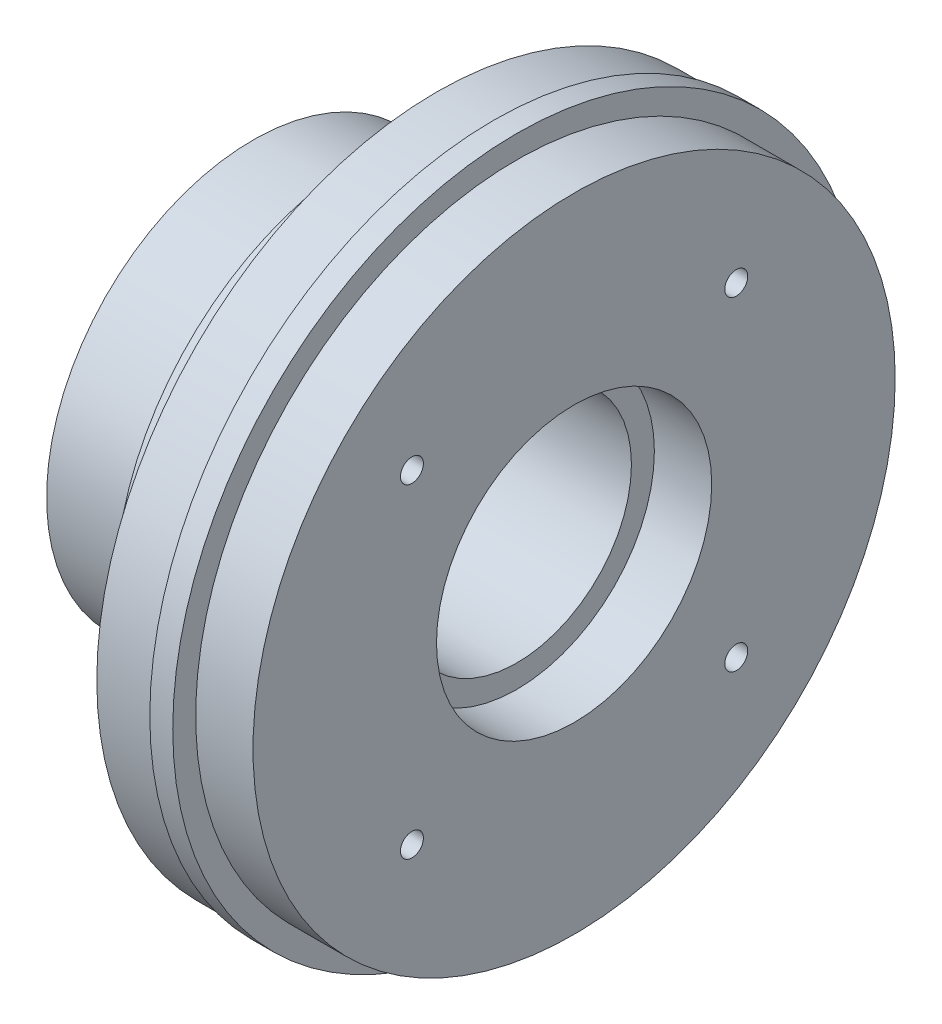
ISO-10303-21;
HEADER;
FILE_DESCRIPTION(('STEP AP214'),'2;1');
FILE_NAME('part.step','',(''),(''),'','','');
FILE_SCHEMA(('AUTOMOTIVE_DESIGN { 1 0 10303 214 1 1 1 1 }'));
ENDSEC;
DATA;
#1=APPLICATION_CONTEXT('core data for automotive mechanical design processes');
#2=APPLICATION_PROTOCOL_DEFINITION('international standard','automotive_design',2000,#1);
#3=PRODUCT_CONTEXT('',#1,'mechanical');
#4=PRODUCT('Part','Part','',(#3));
#5=PRODUCT_RELATED_PRODUCT_CATEGORY('part','',(#4));
#6=PRODUCT_DEFINITION_FORMATION('','',#4);
#7=PRODUCT_DEFINITION_CONTEXT('part definition',#1,'design');
#8=PRODUCT_DEFINITION('design','',#6,#7);
#9=PRODUCT_DEFINITION_SHAPE('','',#8);
#10=(LENGTH_UNIT() NAMED_UNIT(*) SI_UNIT(.MILLI.,.METRE.));
#11=(NAMED_UNIT(*) PLANE_ANGLE_UNIT() SI_UNIT($,.RADIAN.));
#12=(NAMED_UNIT(*) SI_UNIT($,.STERADIAN.) SOLID_ANGLE_UNIT());
#13=UNCERTAINTY_MEASURE_WITH_UNIT(LENGTH_MEASURE(1.E-05),#10,'distance_accuracy_value','');
#14=(GEOMETRIC_REPRESENTATION_CONTEXT(3) GLOBAL_UNCERTAINTY_ASSIGNED_CONTEXT((#13)) GLOBAL_UNIT_ASSIGNED_CONTEXT((#10,
#11,#12)) REPRESENTATION_CONTEXT('',''));
#15=CARTESIAN_POINT('',(0.,0.,0.));
#16=DIRECTION('',(0.,0.,1.));
#17=DIRECTION('',(1.,0.,0.));
#18=AXIS2_PLACEMENT_3D('',#15,#16,#17);
#19=CARTESIAN_POINT('',(13.5,0.,0.));
#20=DIRECTION('',(1.,0.,0.));
#21=DIRECTION('',(0.,0.,-1.));
#22=AXIS2_PLACEMENT_3D('',#19,#20,#21);
#23=TOROIDAL_SURFACE('',#22,26.,4.);
#24=CARTESIAN_POINT('',(16.9641016151378,0.,0.));
#25=DIRECTION('',(1.,0.,0.));
#26=DIRECTION('',(0.,0.,-1.));
#27=AXIS2_PLACEMENT_3D('',#24,#25,#26);
#28=CIRCLE('',#27,24.);
#29=CARTESIAN_POINT('',(16.9641016151378,0.,-24.));
#30=VERTEX_POINT('',#29);
#31=EDGE_CURVE('E125',#30,#30,#28,.F.);
#32=ORIENTED_EDGE('',*,*,#31,.F.);
#33=EDGE_LOOP('',(#32));
#34=FACE_BOUND('',#33,.T.);
#35=CARTESIAN_POINT('',(16.,0.,0.));
#36=DIRECTION('',(1.,0.,0.));
#37=DIRECTION('',(0.,0.,-1.));
#38=AXIS2_PLACEMENT_3D('',#35,#36,#37);
#39=CIRCLE('',#38,29.1224989991992);
#40=CARTESIAN_POINT('',(16.,0.,-29.1224989991992));
#41=VERTEX_POINT('',#40);
#42=EDGE_CURVE('E123',#41,#41,#39,.T.);
#43=ORIENTED_EDGE('',*,*,#42,.F.);
#44=EDGE_LOOP('',(#43));
#45=FACE_BOUND('',#44,.T.);
#46=ADVANCED_FACE('F14',(#34,#45),#23,.F.);
#47=CARTESIAN_POINT('',(22.3157894736842,0.,0.));
#48=DIRECTION('',(1.,0.,0.));
#49=DIRECTION('',(0.,0.,-1.));
#50=AXIS2_PLACEMENT_3D('',#47,#48,#49);
#51=CYLINDRICAL_SURFACE('',#50,15.);
#52=CARTESIAN_POINT('',(2.,0.,0.));
#53=DIRECTION('',(1.,0.,0.));
#54=DIRECTION('',(0.,0.,-1.));
#55=AXIS2_PLACEMENT_3D('',#52,#53,#54);
#56=CIRCLE('',#55,15.);
#57=CARTESIAN_POINT('',(2.,0.,-15.));
#58=VERTEX_POINT('',#57);
#59=EDGE_CURVE('E120',#58,#58,#56,.F.);
#60=ORIENTED_EDGE('',*,*,#59,.F.);
#61=EDGE_LOOP('',(#60));
#62=FACE_BOUND('',#61,.T.);
#63=CARTESIAN_POINT('',(0.,0.,0.));
#64=DIRECTION('',(1.,0.,0.));
#65=DIRECTION('',(0.,0.,-1.));
#66=AXIS2_PLACEMENT_3D('',#63,#64,#65);
#67=CIRCLE('',#66,15.);
#68=CARTESIAN_POINT('',(0.,0.,-15.));
#69=VERTEX_POINT('',#68);
#70=EDGE_CURVE('E18',#69,#69,#67,.T.);
#71=ORIENTED_EDGE('',*,*,#70,.F.);
#72=EDGE_LOOP('',(#71));
#73=FACE_BOUND('',#72,.T.);
#74=ADVANCED_FACE('F134',(#62,#73),#51,.F.);
#75=CARTESIAN_POINT('',(0.,18.,0.));
#76=DIRECTION('',(-1.,0.,0.));
#77=DIRECTION('',(0.,0.,1.));
#78=AXIS2_PLACEMENT_3D('',#75,#76,#77);
#79=PLANE('',#78);
#80=CARTESIAN_POINT('',(0.,0.,0.));
#81=DIRECTION('',(1.,0.,0.));
#82=DIRECTION('',(0.,0.,-1.));
#83=AXIS2_PLACEMENT_3D('',#80,#81,#82);
#84=CIRCLE('',#83,18.);
#85=CARTESIAN_POINT('',(0.,0.,-18.));
#86=VERTEX_POINT('',#85);
#87=EDGE_CURVE('E117',#86,#86,#84,.T.);
#88=ORIENTED_EDGE('',*,*,#87,.F.);
#89=EDGE_LOOP('',(#88));
#90=FACE_BOUND('',#89,.T.);
#91=ORIENTED_EDGE('',*,*,#70,.T.);
#92=EDGE_LOOP('',(#91));
#93=FACE_BOUND('',#92,.T.);
#94=ADVANCED_FACE('F132',(#90,#93),#79,.T.);
#95=CARTESIAN_POINT('',(16.9641016151378,24.,0.));
#96=DIRECTION('',(-1.,0.,0.));
#97=DIRECTION('',(0.,0.,1.));
#98=AXIS2_PLACEMENT_3D('',#95,#96,#97);
#99=PLANE('',#98);
#100=ORIENTED_EDGE('',*,*,#31,.T.);
#101=EDGE_LOOP('',(#100));
#102=FACE_BOUND('',#101,.T.);
#103=CARTESIAN_POINT('',(16.9641016151378,0.,0.));
#104=DIRECTION('',(1.,0.,0.));
#105=DIRECTION('',(0.,0.,-1.));
#106=AXIS2_PLACEMENT_3D('',#103,#104,#105);
#107=CIRCLE('',#106,22.);
#108=CARTESIAN_POINT('',(16.9641016151378,0.,-22.));
#109=VERTEX_POINT('',#108);
#110=EDGE_CURVE('E114',#109,#109,#107,.F.);
#111=ORIENTED_EDGE('',*,*,#110,.F.);
#112=EDGE_LOOP('',(#111));
#113=FACE_BOUND('',#112,.T.);
#114=ADVANCED_FACE('F142',(#102,#113),#99,.T.);
#115=CARTESIAN_POINT('',(16.,29.6224989991992,0.));
#116=DIRECTION('',(-1.,0.,0.));
#117=DIRECTION('',(0.,0.,1.));
#118=AXIS2_PLACEMENT_3D('',#115,#116,#117);
#119=PLANE('',#118);
#120=CARTESIAN_POINT('',(16.,0.,0.));
#121=DIRECTION('',(1.,0.,0.));
#122=DIRECTION('',(0.,0.,-1.));
#123=AXIS2_PLACEMENT_3D('',#120,#121,#122);
#124=CIRCLE('',#123,29.6224989991992);
#125=CARTESIAN_POINT('',(16.,0.,-29.6224989991992));
#126=VERTEX_POINT('',#125);
#127=EDGE_CURVE('E111',#126,#126,#124,.T.);
#128=ORIENTED_EDGE('',*,*,#127,.F.);
#129=EDGE_LOOP('',(#128));
#130=FACE_BOUND('',#129,.T.);
#131=ORIENTED_EDGE('',*,*,#42,.T.);
#132=EDGE_LOOP('',(#131));
#133=FACE_BOUND('',#132,.T.);
#134=ADVANCED_FACE('F258',(#130,#133),#119,.T.);
#135=CARTESIAN_POINT('',(2.,15.,0.));
#136=DIRECTION('',(-1.,0.,0.));
#137=DIRECTION('',(0.,0.,1.));
#138=AXIS2_PLACEMENT_3D('',#135,#136,#137);
#139=PLANE('',#138);
#140=ORIENTED_EDGE('',*,*,#59,.T.);
#141=EDGE_LOOP('',(#140));
#142=FACE_BOUND('',#141,.T.);
#143=CARTESIAN_POINT('',(2.,0.,0.));
#144=DIRECTION('',(1.,0.,0.));
#145=DIRECTION('',(0.,0.,-1.));
#146=AXIS2_PLACEMENT_3D('',#143,#144,#145);
#147=CIRCLE('',#146,13.);
#148=CARTESIAN_POINT('',(2.,0.,-13.));
#149=VERTEX_POINT('',#148);
#150=EDGE_CURVE('E108',#149,#149,#147,.F.);
#151=ORIENTED_EDGE('',*,*,#150,.F.);
#152=EDGE_LOOP('',(#151));
#153=FACE_BOUND('',#152,.T.);
#154=ADVANCED_FACE('F254',(#142,#153),#139,.T.);
#155=CARTESIAN_POINT('',(22.3157894736842,0.,0.));
#156=DIRECTION('',(1.,0.,0.));
#157=DIRECTION('',(0.,0.,-1.));
#158=AXIS2_PLACEMENT_3D('',#155,#156,#157);
#159=CYLINDRICAL_SURFACE('',#158,18.);
#160=ORIENTED_EDGE('',*,*,#87,.T.);
#161=EDGE_LOOP('',(#160));
#162=FACE_BOUND('',#161,.T.);
#163=CARTESIAN_POINT('',(10.,0.,0.));
#164=DIRECTION('',(1.,0.,0.));
#165=DIRECTION('',(0.,0.,-1.));
#166=AXIS2_PLACEMENT_3D('',#163,#164,#165);
#167=CIRCLE('',#166,18.);
#168=CARTESIAN_POINT('',(10.,0.,-18.));
#169=VERTEX_POINT('',#168);
#170=EDGE_CURVE('E105',#169,#169,#167,.T.);
#171=ORIENTED_EDGE('',*,*,#170,.F.);
#172=EDGE_LOOP('',(#171));
#173=FACE_BOUND('',#172,.T.);
#174=ADVANCED_FACE('F250',(#162,#173),#159,.T.);
#175=CARTESIAN_POINT('',(22.3157894736842,0.,0.));
#176=DIRECTION('',(1.,0.,0.));
#177=DIRECTION('',(0.,0.,-1.));
#178=AXIS2_PLACEMENT_3D('',#175,#176,#177);
#179=CYLINDRICAL_SURFACE('',#178,22.);
#180=CARTESIAN_POINT('',(10.,0.,0.));
#181=DIRECTION('',(1.,0.,0.));
#182=DIRECTION('',(0.,0.,-1.));
#183=AXIS2_PLACEMENT_3D('',#180,#181,#182);
#184=CIRCLE('',#183,22.);
#185=CARTESIAN_POINT('',(10.,0.,-22.));
#186=VERTEX_POINT('',#185);
#187=EDGE_CURVE('E102',#186,#186,#184,.F.);
#188=ORIENTED_EDGE('',*,*,#187,.F.);
#189=EDGE_LOOP('',(#188));
#190=FACE_BOUND('',#189,.T.);
#191=ORIENTED_EDGE('',*,*,#110,.T.);
#192=EDGE_LOOP('',(#191));
#193=FACE_BOUND('',#192,.T.);
#194=ADVANCED_FACE('F246',(#190,#193),#179,.T.);
#195=CARTESIAN_POINT('',(22.3157894736842,0.,0.));
#196=DIRECTION('',(1.,0.,0.));
#197=DIRECTION('',(0.,0.,-1.));
#198=AXIS2_PLACEMENT_3D('',#195,#196,#197);
#199=CYLINDRICAL_SURFACE('',#198,29.6224989991992);
#200=ORIENTED_EDGE('',*,*,#127,.T.);
#201=EDGE_LOOP('',(#200));
#202=FACE_BOUND('',#201,.T.);
#203=CARTESIAN_POINT('',(21.,0.,0.));
#204=DIRECTION('',(1.,0.,0.));
#205=DIRECTION('',(0.,0.,-1.));
#206=AXIS2_PLACEMENT_3D('',#203,#204,#205);
#207=CIRCLE('',#206,29.6224989991992);
#208=CARTESIAN_POINT('',(21.,0.,-29.6224989991992));
#209=VERTEX_POINT('',#208);
#210=EDGE_CURVE('E99',#209,#209,#207,.T.);
#211=ORIENTED_EDGE('',*,*,#210,.F.);
#212=EDGE_LOOP('',(#211));
#213=FACE_BOUND('',#212,.T.);
#214=ADVANCED_FACE('F242',(#202,#213),#199,.T.);
#215=CARTESIAN_POINT('',(22.3157894736842,0.,0.));
#216=DIRECTION('',(1.,0.,0.));
#217=DIRECTION('',(0.,0.,-1.));
#218=AXIS2_PLACEMENT_3D('',#215,#216,#217);
#219=CYLINDRICAL_SURFACE('',#218,13.);
#220=CARTESIAN_POINT('',(0.,0.,0.));
#221=DIRECTION('',(1.,0.,0.));
#222=DIRECTION('',(0.,0.,-1.));
#223=AXIS2_PLACEMENT_3D('',#220,#221,#222);
#224=CIRCLE('',#223,13.);
#225=CARTESIAN_POINT('',(0.,0.,-13.));
#226=VERTEX_POINT('',#225);
#227=EDGE_CURVE('E96',#226,#226,#224,.F.);
#228=ORIENTED_EDGE('',*,*,#227,.F.);
#229=EDGE_LOOP('',(#228));
#230=FACE_BOUND('',#229,.T.);
#231=ORIENTED_EDGE('',*,*,#150,.T.);
#232=EDGE_LOOP('',(#231));
#233=FACE_BOUND('',#232,.T.);
#234=ADVANCED_FACE('F238',(#230,#233),#219,.T.);
#235=CARTESIAN_POINT('',(10.,22.,0.));
#236=DIRECTION('',(-1.,0.,0.));
#237=DIRECTION('',(0.,0.,1.));
#238=AXIS2_PLACEMENT_3D('',#235,#236,#237);
#239=PLANE('',#238);
#240=ORIENTED_EDGE('',*,*,#187,.T.);
#241=EDGE_LOOP('',(#240));
#242=FACE_BOUND('',#241,.T.);
#243=ORIENTED_EDGE('',*,*,#170,.T.);
#244=EDGE_LOOP('',(#243));
#245=FACE_BOUND('',#244,.T.);
#246=CARTESIAN_POINT('',(10.,14.142135623731,14.1421356237309));
#247=DIRECTION('',(-1.,0.,0.));
#248=DIRECTION('',(0.,0.,1.));
#249=AXIS2_PLACEMENT_3D('',#246,#247,#248);
#250=CIRCLE('',#249,1.9);
#251=CARTESIAN_POINT('',(10.,14.142135623731,16.0421356237309));
#252=VERTEX_POINT('',#251);
#253=EDGE_CURVE('E84',#252,#252,#250,.F.);
#254=ORIENTED_EDGE('',*,*,#253,.T.);
#255=EDGE_LOOP('',(#254));
#256=FACE_BOUND('',#255,.T.);
#257=CARTESIAN_POINT('',(10.,-14.1421356237309,14.142135623731));
#258=DIRECTION('',(-1.,0.,0.));
#259=DIRECTION('',(0.,0.,1.));
#260=AXIS2_PLACEMENT_3D('',#257,#258,#259);
#261=CIRCLE('',#260,1.9);
#262=CARTESIAN_POINT('',(10.,-14.1421356237309,16.042135623731));
#263=VERTEX_POINT('',#262);
#264=EDGE_CURVE('E87',#263,#263,#261,.F.);
#265=ORIENTED_EDGE('',*,*,#264,.T.);
#266=EDGE_LOOP('',(#265));
#267=FACE_BOUND('',#266,.T.);
#268=CARTESIAN_POINT('',(10.,-14.142135623731,-14.1421356237309));
#269=DIRECTION('',(-1.,0.,0.));
#270=DIRECTION('',(0.,0.,1.));
#271=AXIS2_PLACEMENT_3D('',#268,#269,#270);
#272=CIRCLE('',#271,1.9);
#273=CARTESIAN_POINT('',(10.,-14.142135623731,-12.2421356237309));
#274=VERTEX_POINT('',#273);
#275=EDGE_CURVE('E90',#274,#274,#272,.F.);
#276=ORIENTED_EDGE('',*,*,#275,.T.);
#277=EDGE_LOOP('',(#276));
#278=FACE_BOUND('',#277,.T.);
#279=CARTESIAN_POINT('',(10.,14.1421356237309,-14.142135623731));
#280=DIRECTION('',(-1.,0.,0.));
#281=DIRECTION('',(0.,0.,1.));
#282=AXIS2_PLACEMENT_3D('',#279,#280,#281);
#283=CIRCLE('',#282,1.9);
#284=CARTESIAN_POINT('',(10.,14.1421356237309,-12.242135623731));
#285=VERTEX_POINT('',#284);
#286=EDGE_CURVE('E93',#285,#285,#283,.F.);
#287=ORIENTED_EDGE('',*,*,#286,.T.);
#288=EDGE_LOOP('',(#287));
#289=FACE_BOUND('',#288,.T.);
#290=ADVANCED_FACE('F234',(#242,#245,#256,#267,#278,#289),#239,.T.);
#291=CARTESIAN_POINT('',(21.,29.6224989991992,0.));
#292=DIRECTION('',(-1.,0.,0.));
#293=DIRECTION('',(0.,0.,1.));
#294=AXIS2_PLACEMENT_3D('',#291,#292,#293);
#295=PLANE('',#294);
#296=CARTESIAN_POINT('',(21.,0.,0.));
#297=DIRECTION('',(1.,0.,0.));
#298=DIRECTION('',(0.,0.,-1.));
#299=AXIS2_PLACEMENT_3D('',#296,#297,#298);
#300=CIRCLE('',#299,30.);
#301=CARTESIAN_POINT('',(21.,0.,-30.));
#302=VERTEX_POINT('',#301);
#303=EDGE_CURVE('E81',#302,#302,#300,.T.);
#304=ORIENTED_EDGE('',*,*,#303,.F.);
#305=EDGE_LOOP('',(#304));
#306=FACE_BOUND('',#305,.T.);
#307=ORIENTED_EDGE('',*,*,#210,.T.);
#308=EDGE_LOOP('',(#307));
#309=FACE_BOUND('',#308,.T.);
#310=ADVANCED_FACE('F230',(#306,#309),#295,.T.);
#311=CARTESIAN_POINT('',(0.,13.,0.));
#312=DIRECTION('',(-1.,0.,0.));
#313=DIRECTION('',(0.,0.,1.));
#314=AXIS2_PLACEMENT_3D('',#311,#312,#313);
#315=PLANE('',#314);
#316=ORIENTED_EDGE('',*,*,#227,.T.);
#317=EDGE_LOOP('',(#316));
#318=FACE_BOUND('',#317,.T.);
#319=CARTESIAN_POINT('',(0.,0.,0.));
#320=DIRECTION('',(1.,0.,0.));
#321=DIRECTION('',(0.,0.,-1.));
#322=AXIS2_PLACEMENT_3D('',#319,#320,#321);
#323=CIRCLE('',#322,10.);
#324=CARTESIAN_POINT('',(0.,0.,-10.));
#325=VERTEX_POINT('',#324);
#326=EDGE_CURVE('E78',#325,#325,#323,.T.);
#327=ORIENTED_EDGE('',*,*,#326,.T.);
#328=EDGE_LOOP('',(#327));
#329=FACE_BOUND('',#328,.T.);
#330=ADVANCED_FACE('F226',(#318,#329),#315,.T.);
#331=CARTESIAN_POINT('',(22.,14.1421356237309,-14.142135623731));
#332=DIRECTION('',(-1.,0.,0.));
#333=DIRECTION('',(0.,0.,1.));
#334=AXIS2_PLACEMENT_3D('',#331,#332,#333);
#335=CYLINDRICAL_SURFACE('',#334,1.9);
#336=ORIENTED_EDGE('',*,*,#286,.F.);
#337=EDGE_LOOP('',(#336));
#338=FACE_BOUND('',#337,.T.);
#339=CARTESIAN_POINT('',(22.,14.1421356237309,-14.142135623731));
#340=DIRECTION('',(-1.,0.,0.));
#341=DIRECTION('',(0.,0.,1.));
#342=AXIS2_PLACEMENT_3D('',#339,#340,#341);
#343=CIRCLE('',#342,1.9);
#344=CARTESIAN_POINT('',(22.,14.1421356237309,-12.242135623731));
#345=VERTEX_POINT('',#344);
#346=EDGE_CURVE('E75',#345,#345,#343,.T.);
#347=ORIENTED_EDGE('',*,*,#346,.F.);
#348=EDGE_LOOP('',(#347));
#349=FACE_BOUND('',#348,.T.);
#350=ADVANCED_FACE('F222',(#338,#349),#335,.F.);
#351=CARTESIAN_POINT('',(22.,-14.142135623731,-14.1421356237309));
#352=DIRECTION('',(-1.,0.,0.));
#353=DIRECTION('',(0.,0.,1.));
#354=AXIS2_PLACEMENT_3D('',#351,#352,#353);
#355=CYLINDRICAL_SURFACE('',#354,1.9);
#356=ORIENTED_EDGE('',*,*,#275,.F.);
#357=EDGE_LOOP('',(#356));
#358=FACE_BOUND('',#357,.T.);
#359=CARTESIAN_POINT('',(22.,-14.142135623731,-14.1421356237309));
#360=DIRECTION('',(-1.,0.,0.));
#361=DIRECTION('',(0.,0.,1.));
#362=AXIS2_PLACEMENT_3D('',#359,#360,#361);
#363=CIRCLE('',#362,1.9);
#364=CARTESIAN_POINT('',(22.,-14.142135623731,-12.2421356237309));
#365=VERTEX_POINT('',#364);
#366=EDGE_CURVE('E72',#365,#365,#363,.T.);
#367=ORIENTED_EDGE('',*,*,#366,.F.);
#368=EDGE_LOOP('',(#367));
#369=FACE_BOUND('',#368,.T.);
#370=ADVANCED_FACE('F218',(#358,#369),#355,.F.);
#371=CARTESIAN_POINT('',(22.,-14.1421356237309,14.142135623731));
#372=DIRECTION('',(-1.,0.,0.));
#373=DIRECTION('',(0.,0.,1.));
#374=AXIS2_PLACEMENT_3D('',#371,#372,#373);
#375=CYLINDRICAL_SURFACE('',#374,1.9);
#376=ORIENTED_EDGE('',*,*,#264,.F.);
#377=EDGE_LOOP('',(#376));
#378=FACE_BOUND('',#377,.T.);
#379=CARTESIAN_POINT('',(22.,-14.1421356237309,14.142135623731));
#380=DIRECTION('',(-1.,0.,0.));
#381=DIRECTION('',(0.,0.,1.));
#382=AXIS2_PLACEMENT_3D('',#379,#380,#381);
#383=CIRCLE('',#382,1.9);
#384=CARTESIAN_POINT('',(22.,-14.1421356237309,16.042135623731));
#385=VERTEX_POINT('',#384);
#386=EDGE_CURVE('E69',#385,#385,#383,.T.);
#387=ORIENTED_EDGE('',*,*,#386,.F.);
#388=EDGE_LOOP('',(#387));
#389=FACE_BOUND('',#388,.T.);
#390=ADVANCED_FACE('F214',(#378,#389),#375,.F.);
#391=CARTESIAN_POINT('',(22.,14.142135623731,14.1421356237309));
#392=DIRECTION('',(-1.,0.,0.));
#393=DIRECTION('',(0.,0.,1.));
#394=AXIS2_PLACEMENT_3D('',#391,#392,#393);
#395=CYLINDRICAL_SURFACE('',#394,1.9);
#396=ORIENTED_EDGE('',*,*,#253,.F.);
#397=EDGE_LOOP('',(#396));
#398=FACE_BOUND('',#397,.T.);
#399=CARTESIAN_POINT('',(22.,14.142135623731,14.1421356237309));
#400=DIRECTION('',(-1.,0.,0.));
#401=DIRECTION('',(0.,0.,1.));
#402=AXIS2_PLACEMENT_3D('',#399,#400,#401);
#403=CIRCLE('',#402,1.9);
#404=CARTESIAN_POINT('',(22.,14.142135623731,16.0421356237309));
#405=VERTEX_POINT('',#404);
#406=EDGE_CURVE('E66',#405,#405,#403,.T.);
#407=ORIENTED_EDGE('',*,*,#406,.F.);
#408=EDGE_LOOP('',(#407));
#409=FACE_BOUND('',#408,.T.);
#410=ADVANCED_FACE('F210',(#398,#409),#395,.F.);
#411=CARTESIAN_POINT('',(22.3157894736842,0.,0.));
#412=DIRECTION('',(1.,0.,0.));
#413=DIRECTION('',(0.,0.,-1.));
#414=AXIS2_PLACEMENT_3D('',#411,#412,#413);
#415=CYLINDRICAL_SURFACE('',#414,30.);
#416=ORIENTED_EDGE('',*,*,#303,.T.);
#417=EDGE_LOOP('',(#416));
#418=FACE_BOUND('',#417,.T.);
#419=CARTESIAN_POINT('',(23.,0.,0.));
#420=DIRECTION('',(1.,0.,0.));
#421=DIRECTION('',(0.,0.,-1.));
#422=AXIS2_PLACEMENT_3D('',#419,#420,#421);
#423=CIRCLE('',#422,30.);
#424=CARTESIAN_POINT('',(23.,0.,-30.));
#425=VERTEX_POINT('',#424);
#426=EDGE_CURVE('E63',#425,#425,#423,.T.);
#427=ORIENTED_EDGE('',*,*,#426,.F.);
#428=EDGE_LOOP('',(#427));
#429=FACE_BOUND('',#428,.T.);
#430=ADVANCED_FACE('F206',(#418,#429),#415,.T.);
#431=CARTESIAN_POINT('',(22.3157894736842,0.,0.));
#432=DIRECTION('',(1.,0.,0.));
#433=DIRECTION('',(0.,0.,-1.));
#434=AXIS2_PLACEMENT_3D('',#431,#432,#433);
#435=CYLINDRICAL_SURFACE('',#434,10.);
#436=CARTESIAN_POINT('',(23.,0.,0.));
#437=DIRECTION('',(1.,0.,0.));
#438=DIRECTION('',(0.,0.,-1.));
#439=AXIS2_PLACEMENT_3D('',#436,#437,#438);
#440=CIRCLE('',#439,10.);
#441=CARTESIAN_POINT('',(23.,0.,-10.));
#442=VERTEX_POINT('',#441);
#443=EDGE_CURVE('E60',#442,#442,#440,.F.);
#444=ORIENTED_EDGE('',*,*,#443,.F.);
#445=EDGE_LOOP('',(#444));
#446=FACE_BOUND('',#445,.T.);
#447=ORIENTED_EDGE('',*,*,#326,.F.);
#448=EDGE_LOOP('',(#447));
#449=FACE_BOUND('',#448,.T.);
#450=ADVANCED_FACE('F202',(#446,#449),#435,.F.);
#451=CARTESIAN_POINT('',(22.,14.1421356237309,-14.142135623731));
#452=DIRECTION('',(-1.,0.,0.));
#453=DIRECTION('',(0.,0.,1.));
#454=AXIS2_PLACEMENT_3D('',#451,#452,#453);
#455=PLANE('',#454);
#456=CARTESIAN_POINT('',(22.,14.1421356237309,-14.142135623731));
#457=DIRECTION('',(-1.,0.,0.));
#458=DIRECTION('',(0.,0.,1.));
#459=AXIS2_PLACEMENT_3D('',#456,#457,#458);
#460=CIRCLE('',#459,1.);
#461=CARTESIAN_POINT('',(22.,14.1421356237309,-13.142135623731));
#462=VERTEX_POINT('',#461);
#463=EDGE_CURVE('E57',#462,#462,#460,.F.);
#464=ORIENTED_EDGE('',*,*,#463,.T.);
#465=EDGE_LOOP('',(#464));
#466=FACE_BOUND('',#465,.T.);
#467=ORIENTED_EDGE('',*,*,#346,.T.);
#468=EDGE_LOOP('',(#467));
#469=FACE_BOUND('',#468,.T.);
#470=ADVANCED_FACE('F198',(#466,#469),#455,.T.);
#471=CARTESIAN_POINT('',(22.,-14.142135623731,-14.1421356237309));
#472=DIRECTION('',(-1.,0.,0.));
#473=DIRECTION('',(0.,0.,1.));
#474=AXIS2_PLACEMENT_3D('',#471,#472,#473);
#475=PLANE('',#474);
#476=CARTESIAN_POINT('',(22.,-14.142135623731,-14.1421356237309));
#477=DIRECTION('',(-1.,0.,0.));
#478=DIRECTION('',(0.,0.,1.));
#479=AXIS2_PLACEMENT_3D('',#476,#477,#478);
#480=CIRCLE('',#479,1.);
#481=CARTESIAN_POINT('',(22.,-14.142135623731,-13.1421356237309));
#482=VERTEX_POINT('',#481);
#483=EDGE_CURVE('E54',#482,#482,#480,.F.);
#484=ORIENTED_EDGE('',*,*,#483,.T.);
#485=EDGE_LOOP('',(#484));
#486=FACE_BOUND('',#485,.T.);
#487=ORIENTED_EDGE('',*,*,#366,.T.);
#488=EDGE_LOOP('',(#487));
#489=FACE_BOUND('',#488,.T.);
#490=ADVANCED_FACE('F194',(#486,#489),#475,.T.);
#491=CARTESIAN_POINT('',(22.,-14.1421356237309,14.142135623731));
#492=DIRECTION('',(-1.,0.,0.));
#493=DIRECTION('',(0.,0.,1.));
#494=AXIS2_PLACEMENT_3D('',#491,#492,#493);
#495=PLANE('',#494);
#496=CARTESIAN_POINT('',(22.,-14.1421356237309,14.142135623731));
#497=DIRECTION('',(-1.,0.,0.));
#498=DIRECTION('',(0.,0.,1.));
#499=AXIS2_PLACEMENT_3D('',#496,#497,#498);
#500=CIRCLE('',#499,1.00000000000004);
#501=CARTESIAN_POINT('',(22.,-14.1421356237309,15.1421356237311));
#502=VERTEX_POINT('',#501);
#503=EDGE_CURVE('E51',#502,#502,#500,.F.);
#504=ORIENTED_EDGE('',*,*,#503,.T.);
#505=EDGE_LOOP('',(#504));
#506=FACE_BOUND('',#505,.T.);
#507=ORIENTED_EDGE('',*,*,#386,.T.);
#508=EDGE_LOOP('',(#507));
#509=FACE_BOUND('',#508,.T.);
#510=ADVANCED_FACE('F190',(#506,#509),#495,.T.);
#511=CARTESIAN_POINT('',(22.,14.142135623731,14.1421356237309));
#512=DIRECTION('',(-1.,0.,0.));
#513=DIRECTION('',(0.,0.,1.));
#514=AXIS2_PLACEMENT_3D('',#511,#512,#513);
#515=PLANE('',#514);
#516=CARTESIAN_POINT('',(22.,14.142135623731,14.1421356237309));
#517=DIRECTION('',(-1.,0.,0.));
#518=DIRECTION('',(0.,0.,1.));
#519=AXIS2_PLACEMENT_3D('',#516,#517,#518);
#520=CIRCLE('',#519,0.999999999999999);
#521=CARTESIAN_POINT('',(22.,14.142135623731,15.1421356237309));
#522=VERTEX_POINT('',#521);
#523=EDGE_CURVE('E48',#522,#522,#520,.F.);
#524=ORIENTED_EDGE('',*,*,#523,.T.);
#525=EDGE_LOOP('',(#524));
#526=FACE_BOUND('',#525,.T.);
#527=ORIENTED_EDGE('',*,*,#406,.T.);
#528=EDGE_LOOP('',(#527));
#529=FACE_BOUND('',#528,.T.);
#530=ADVANCED_FACE('F186',(#526,#529),#515,.T.);
#531=CARTESIAN_POINT('',(23.,28.,0.));
#532=DIRECTION('',(1.,0.,0.));
#533=DIRECTION('',(0.,0.,-1.));
#534=AXIS2_PLACEMENT_3D('',#531,#532,#533);
#535=PLANE('',#534);
#536=CARTESIAN_POINT('',(23.,0.,0.));
#537=DIRECTION('',(1.,0.,0.));
#538=DIRECTION('',(0.,0.,-1.));
#539=AXIS2_PLACEMENT_3D('',#536,#537,#538);
#540=CIRCLE('',#539,28.);
#541=CARTESIAN_POINT('',(23.,0.,-28.));
#542=VERTEX_POINT('',#541);
#543=EDGE_CURVE('E45',#542,#542,#540,.T.);
#544=ORIENTED_EDGE('',*,*,#543,.F.);
#545=EDGE_LOOP('',(#544));
#546=FACE_BOUND('',#545,.T.);
#547=ORIENTED_EDGE('',*,*,#426,.T.);
#548=EDGE_LOOP('',(#547));
#549=FACE_BOUND('',#548,.T.);
#550=ADVANCED_FACE('F182',(#546,#549),#535,.T.);
#551=CARTESIAN_POINT('',(23.,10.,0.));
#552=DIRECTION('',(1.,0.,0.));
#553=DIRECTION('',(0.,0.,-1.));
#554=AXIS2_PLACEMENT_3D('',#551,#552,#553);
#555=PLANE('',#554);
#556=ORIENTED_EDGE('',*,*,#443,.T.);
#557=EDGE_LOOP('',(#556));
#558=FACE_BOUND('',#557,.T.);
#559=CARTESIAN_POINT('',(23.,0.,0.));
#560=DIRECTION('',(1.,0.,0.));
#561=DIRECTION('',(0.,0.,-1.));
#562=AXIS2_PLACEMENT_3D('',#559,#560,#561);
#563=CIRCLE('',#562,12.);
#564=CARTESIAN_POINT('',(23.,0.,-12.));
#565=VERTEX_POINT('',#564);
#566=EDGE_CURVE('E42',#565,#565,#563,.T.);
#567=ORIENTED_EDGE('',*,*,#566,.T.);
#568=EDGE_LOOP('',(#567));
#569=FACE_BOUND('',#568,.T.);
#570=ADVANCED_FACE('F178',(#558,#569),#555,.T.);
#571=CARTESIAN_POINT('',(28.,14.1421356237309,-14.142135623731));
#572=DIRECTION('',(-1.,0.,0.));
#573=DIRECTION('',(0.,0.,1.));
#574=AXIS2_PLACEMENT_3D('',#571,#572,#573);
#575=CYLINDRICAL_SURFACE('',#574,1.);
#576=ORIENTED_EDGE('',*,*,#463,.F.);
#577=EDGE_LOOP('',(#576));
#578=FACE_BOUND('',#577,.T.);
#579=CARTESIAN_POINT('',(28.,14.1421356237309,-14.142135623731));
#580=DIRECTION('',(-1.,0.,0.));
#581=DIRECTION('',(0.,0.,1.));
#582=AXIS2_PLACEMENT_3D('',#579,#580,#581);
#583=CIRCLE('',#582,1.);
#584=CARTESIAN_POINT('',(28.,14.1421356237309,-13.142135623731));
#585=VERTEX_POINT('',#584);
#586=EDGE_CURVE('E39',#585,#585,#583,.T.);
#587=ORIENTED_EDGE('',*,*,#586,.F.);
#588=EDGE_LOOP('',(#587));
#589=FACE_BOUND('',#588,.T.);
#590=ADVANCED_FACE('F174',(#578,#589),#575,.F.);
#591=CARTESIAN_POINT('',(28.,-14.142135623731,-14.1421356237309));
#592=DIRECTION('',(-1.,0.,0.));
#593=DIRECTION('',(0.,0.,1.));
#594=AXIS2_PLACEMENT_3D('',#591,#592,#593);
#595=CYLINDRICAL_SURFACE('',#594,1.);
#596=ORIENTED_EDGE('',*,*,#483,.F.);
#597=EDGE_LOOP('',(#596));
#598=FACE_BOUND('',#597,.T.);
#599=CARTESIAN_POINT('',(28.,-14.142135623731,-14.1421356237309));
#600=DIRECTION('',(-1.,0.,0.));
#601=DIRECTION('',(0.,0.,1.));
#602=AXIS2_PLACEMENT_3D('',#599,#600,#601);
#603=CIRCLE('',#602,1.);
#604=CARTESIAN_POINT('',(28.,-14.142135623731,-13.1421356237309));
#605=VERTEX_POINT('',#604);
#606=EDGE_CURVE('E36',#605,#605,#603,.T.);
#607=ORIENTED_EDGE('',*,*,#606,.F.);
#608=EDGE_LOOP('',(#607));
#609=FACE_BOUND('',#608,.T.);
#610=ADVANCED_FACE('F170',(#598,#609),#595,.F.);
#611=CARTESIAN_POINT('',(28.,-14.1421356237309,14.142135623731));
#612=DIRECTION('',(-1.,0.,0.));
#613=DIRECTION('',(0.,0.,1.));
#614=AXIS2_PLACEMENT_3D('',#611,#612,#613);
#615=CYLINDRICAL_SURFACE('',#614,1.00000000000004);
#616=ORIENTED_EDGE('',*,*,#503,.F.);
#617=EDGE_LOOP('',(#616));
#618=FACE_BOUND('',#617,.T.);
#619=CARTESIAN_POINT('',(28.,-14.1421356237309,14.142135623731));
#620=DIRECTION('',(-1.,0.,0.));
#621=DIRECTION('',(0.,0.,1.));
#622=AXIS2_PLACEMENT_3D('',#619,#620,#621);
#623=CIRCLE('',#622,1.00000000000004);
#624=CARTESIAN_POINT('',(28.,-14.1421356237309,15.1421356237311));
#625=VERTEX_POINT('',#624);
#626=EDGE_CURVE('E33',#625,#625,#623,.T.);
#627=ORIENTED_EDGE('',*,*,#626,.F.);
#628=EDGE_LOOP('',(#627));
#629=FACE_BOUND('',#628,.T.);
#630=ADVANCED_FACE('F166',(#618,#629),#615,.F.);
#631=CARTESIAN_POINT('',(28.,14.142135623731,14.1421356237309));
#632=DIRECTION('',(-1.,0.,0.));
#633=DIRECTION('',(0.,0.,1.));
#634=AXIS2_PLACEMENT_3D('',#631,#632,#633);
#635=CYLINDRICAL_SURFACE('',#634,0.999999999999999);
#636=ORIENTED_EDGE('',*,*,#523,.F.);
#637=EDGE_LOOP('',(#636));
#638=FACE_BOUND('',#637,.T.);
#639=CARTESIAN_POINT('',(28.,14.142135623731,14.1421356237309));
#640=DIRECTION('',(-1.,0.,0.));
#641=DIRECTION('',(0.,0.,1.));
#642=AXIS2_PLACEMENT_3D('',#639,#640,#641);
#643=CIRCLE('',#642,0.999999999999999);
#644=CARTESIAN_POINT('',(28.,14.142135623731,15.1421356237309));
#645=VERTEX_POINT('',#644);
#646=EDGE_CURVE('E27',#645,#645,#643,.T.);
#647=ORIENTED_EDGE('',*,*,#646,.F.);
#648=EDGE_LOOP('',(#647));
#649=FACE_BOUND('',#648,.T.);
#650=ADVANCED_FACE('F162',(#638,#649),#635,.F.);
#651=CARTESIAN_POINT('',(22.3157894736842,0.,0.));
#652=DIRECTION('',(1.,0.,0.));
#653=DIRECTION('',(0.,0.,-1.));
#654=AXIS2_PLACEMENT_3D('',#651,#652,#653);
#655=CYLINDRICAL_SURFACE('',#654,28.);
#656=ORIENTED_EDGE('',*,*,#543,.T.);
#657=EDGE_LOOP('',(#656));
#658=FACE_BOUND('',#657,.T.);
#659=CARTESIAN_POINT('',(28.,0.,0.));
#660=DIRECTION('',(1.,0.,0.));
#661=DIRECTION('',(0.,0.,-1.));
#662=AXIS2_PLACEMENT_3D('',#659,#660,#661);
#663=CIRCLE('',#662,28.);
#664=CARTESIAN_POINT('',(28.,0.,-28.));
#665=VERTEX_POINT('',#664);
#666=EDGE_CURVE('E22',#665,#665,#663,.T.);
#667=ORIENTED_EDGE('',*,*,#666,.F.);
#668=EDGE_LOOP('',(#667));
#669=FACE_BOUND('',#668,.T.);
#670=ADVANCED_FACE('F155',(#658,#669),#655,.T.);
#671=CARTESIAN_POINT('',(22.3157894736842,0.,0.));
#672=DIRECTION('',(1.,0.,0.));
#673=DIRECTION('',(0.,0.,-1.));
#674=AXIS2_PLACEMENT_3D('',#671,#672,#673);
#675=CYLINDRICAL_SURFACE('',#674,12.);
#676=CARTESIAN_POINT('',(28.,0.,0.));
#677=DIRECTION('',(1.,0.,0.));
#678=DIRECTION('',(0.,0.,-1.));
#679=AXIS2_PLACEMENT_3D('',#676,#677,#678);
#680=CIRCLE('',#679,12.);
#681=CARTESIAN_POINT('',(28.,0.,-12.));
#682=VERTEX_POINT('',#681);
#683=EDGE_CURVE('E10',#682,#682,#680,.F.);
#684=ORIENTED_EDGE('',*,*,#683,.F.);
#685=EDGE_LOOP('',(#684));
#686=FACE_BOUND('',#685,.T.);
#687=ORIENTED_EDGE('',*,*,#566,.F.);
#688=EDGE_LOOP('',(#687));
#689=FACE_BOUND('',#688,.T.);
#690=ADVANCED_FACE('F150',(#686,#689),#675,.F.);
#691=CARTESIAN_POINT('',(28.,12.,0.));
#692=DIRECTION('',(1.,0.,0.));
#693=DIRECTION('',(0.,0.,-1.));
#694=AXIS2_PLACEMENT_3D('',#691,#692,#693);
#695=PLANE('',#694);
#696=ORIENTED_EDGE('',*,*,#683,.T.);
#697=EDGE_LOOP('',(#696));
#698=FACE_BOUND('',#697,.T.);
#699=ORIENTED_EDGE('',*,*,#666,.T.);
#700=EDGE_LOOP('',(#699));
#701=FACE_BOUND('',#700,.T.);
#702=ORIENTED_EDGE('',*,*,#646,.T.);
#703=EDGE_LOOP('',(#702));
#704=FACE_BOUND('',#703,.T.);
#705=ORIENTED_EDGE('',*,*,#626,.T.);
#706=EDGE_LOOP('',(#705));
#707=FACE_BOUND('',#706,.T.);
#708=ORIENTED_EDGE('',*,*,#606,.T.);
#709=EDGE_LOOP('',(#708));
#710=FACE_BOUND('',#709,.T.);
#711=ORIENTED_EDGE('',*,*,#586,.T.);
#712=EDGE_LOOP('',(#711));
#713=FACE_BOUND('',#712,.T.);
#714=ADVANCED_FACE('F148',(#698,#701,#704,#707,#710,#713),#695,.T.);
#715=CLOSED_SHELL('',(#46,#74,#94,#114,#134,#154,#174,#194,#214,#234,#290,#310,#330,#350,#370,
#390,#410,#430,#450,#470,#490,#510,#530,#550,#570,#590,#610,#630,#650,#670,#690,#714));
#716=MANIFOLD_SOLID_BREP('B1',#715);
#717=ADVANCED_BREP_SHAPE_REPRESENTATION('',(#18,#716),#14);
#718=SHAPE_DEFINITION_REPRESENTATION(#9,#717);
ENDSEC;
END-ISO-10303-21;
